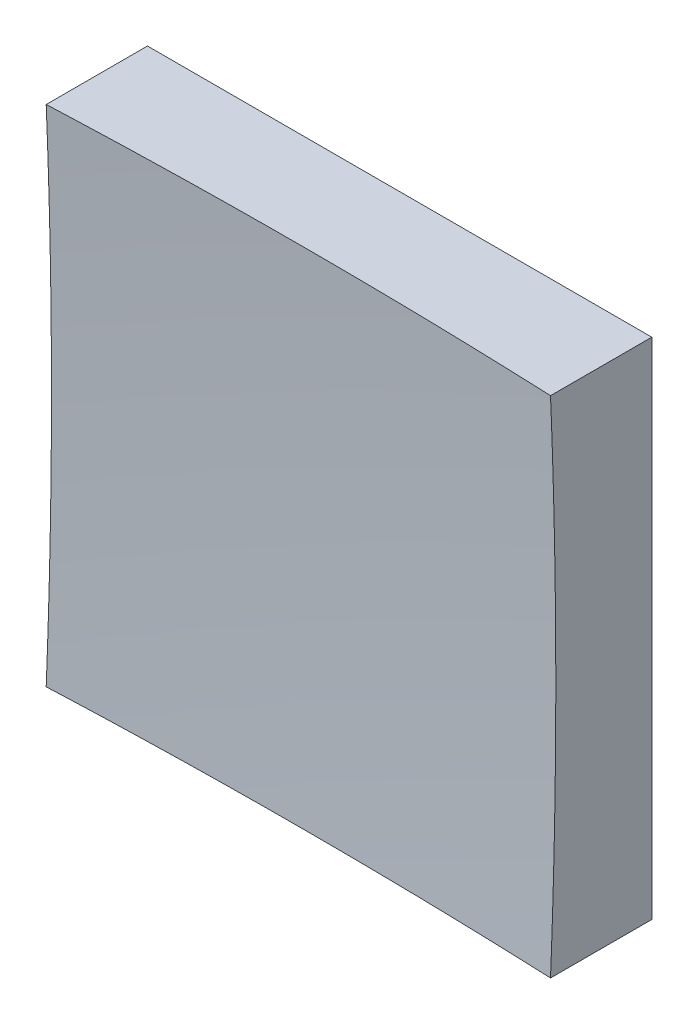
ISO-10303-21;
HEADER;
FILE_DESCRIPTION(('STEP AP214'),'2;1');
FILE_NAME('part.step','',(''),(''),'','','');
FILE_SCHEMA(('AUTOMOTIVE_DESIGN { 1 0 10303 214 1 1 1 1 }'));
ENDSEC;
DATA;
#1=APPLICATION_CONTEXT('core data for automotive mechanical design processes');
#2=APPLICATION_PROTOCOL_DEFINITION('international standard','automotive_design',2000,#1);
#3=PRODUCT_CONTEXT('',#1,'mechanical');
#4=PRODUCT('Part','Part','',(#3));
#5=PRODUCT_RELATED_PRODUCT_CATEGORY('part','',(#4));
#6=PRODUCT_DEFINITION_FORMATION('','',#4);
#7=PRODUCT_DEFINITION_CONTEXT('part definition',#1,'design');
#8=PRODUCT_DEFINITION('design','',#6,#7);
#9=PRODUCT_DEFINITION_SHAPE('','',#8);
#10=(LENGTH_UNIT() NAMED_UNIT(*) SI_UNIT(.MILLI.,.METRE.));
#11=(NAMED_UNIT(*) PLANE_ANGLE_UNIT() SI_UNIT($,.RADIAN.));
#12=(NAMED_UNIT(*) SI_UNIT($,.STERADIAN.) SOLID_ANGLE_UNIT());
#13=UNCERTAINTY_MEASURE_WITH_UNIT(LENGTH_MEASURE(1.E-05),#10,'distance_accuracy_value','');
#14=(GEOMETRIC_REPRESENTATION_CONTEXT(3) GLOBAL_UNCERTAINTY_ASSIGNED_CONTEXT((#13)) GLOBAL_UNIT_ASSIGNED_CONTEXT((#10,
#11,#12)) REPRESENTATION_CONTEXT('',''));
#15=CARTESIAN_POINT('',(0.,0.,0.));
#16=DIRECTION('',(0.,0.,1.));
#17=DIRECTION('',(1.,0.,0.));
#18=AXIS2_PLACEMENT_3D('',#15,#16,#17);
#19=CARTESIAN_POINT('',(-25.,25.,50.));
#20=DIRECTION('',(0.,1.,0.));
#21=DIRECTION('',(0.,0.,1.));
#22=AXIS2_PLACEMENT_3D('',#19,#20,#21);
#23=PLANE('',#22);
#24=CARTESIAN_POINT('',(0.,25.,609.));
#25=DIRECTION('',(0.,1.,0.));
#26=DIRECTION('',(0.,0.,1.));
#27=AXIS2_PLACEMENT_3D('',#24,#25,#26);
#28=CIRCLE('',#27,599.47894041409);
#29=CARTESIAN_POINT('',(25.,25.,10.0425724644531));
#30=VERTEX_POINT('',#29);
#31=CARTESIAN_POINT('',(-25.,25.,10.0425724644531));
#32=VERTEX_POINT('',#31);
#33=EDGE_CURVE('E79',#30,#32,#28,.T.);
#34=ORIENTED_EDGE('',*,*,#33,.F.);
#35=DIRECTION('',(0.,0.,-1.));
#36=VECTOR('',#35,1.);
#37=CARTESIAN_POINT('',(25.,25.,50.));
#38=LINE('',#37,#36);
#39=CARTESIAN_POINT('',(25.,25.,0.));
#40=VERTEX_POINT('',#39);
#41=EDGE_CURVE('E85',#30,#40,#38,.T.);
#42=ORIENTED_EDGE('',*,*,#41,.T.);
#43=DIRECTION('',(1.,0.,0.));
#44=VECTOR('',#43,1.);
#45=CARTESIAN_POINT('',(-25.,25.,0.));
#46=LINE('',#45,#44);
#47=CARTESIAN_POINT('',(-25.,25.,0.));
#48=VERTEX_POINT('',#47);
#49=EDGE_CURVE('E88',#48,#40,#46,.T.);
#50=ORIENTED_EDGE('',*,*,#49,.F.);
#51=DIRECTION('',(0.,0.,-1.));
#52=VECTOR('',#51,1.);
#53=CARTESIAN_POINT('',(-25.,25.,50.));
#54=LINE('',#53,#52);
#55=EDGE_CURVE('E47',#32,#48,#54,.T.);
#56=ORIENTED_EDGE('',*,*,#55,.F.);
#57=EDGE_LOOP('',(#34,#42,#50,#56));
#58=FACE_BOUND('',#57,.T.);
#59=ADVANCED_FACE('F39',(#58),#23,.T.);
#60=CARTESIAN_POINT('',(-25.,25.,50.));
#61=DIRECTION('',(1.,0.,0.));
#62=DIRECTION('',(0.,1.,0.));
#63=AXIS2_PLACEMENT_3D('',#60,#61,#62);
#64=PLANE('',#63);
#65=DIRECTION('',(0.,0.,-1.));
#66=VECTOR('',#65,1.);
#67=CARTESIAN_POINT('',(-25.,-25.,50.));
#68=LINE('',#67,#66);
#69=CARTESIAN_POINT('',(-25.,-25.,10.0425724644531));
#70=VERTEX_POINT('',#69);
#71=CARTESIAN_POINT('',(-25.,-25.,0.));
#72=VERTEX_POINT('',#71);
#73=EDGE_CURVE('E100',#70,#72,#68,.T.);
#74=ORIENTED_EDGE('',*,*,#73,.F.);
#75=CARTESIAN_POINT('',(-25.,0.,609.));
#76=DIRECTION('',(1.,0.,0.));
#77=DIRECTION('',(0.,1.,0.));
#78=AXIS2_PLACEMENT_3D('',#75,#76,#77);
#79=CIRCLE('',#78,599.47894041409);
#80=EDGE_CURVE('E89',#70,#32,#79,.T.);
#81=ORIENTED_EDGE('',*,*,#80,.T.);
#82=ORIENTED_EDGE('',*,*,#55,.T.);
#83=DIRECTION('',(0.,-1.,0.));
#84=VECTOR('',#83,1.);
#85=CARTESIAN_POINT('',(-25.,25.,0.));
#86=LINE('',#85,#84);
#87=EDGE_CURVE('E97',#48,#72,#86,.T.);
#88=ORIENTED_EDGE('',*,*,#87,.T.);
#89=EDGE_LOOP('',(#74,#81,#82,#88));
#90=FACE_BOUND('',#89,.T.);
#91=ADVANCED_FACE('F122',(#90),#64,.F.);
#92=CARTESIAN_POINT('',(-25.,-25.,50.));
#93=DIRECTION('',(0.,1.,0.));
#94=DIRECTION('',(0.,0.,1.));
#95=AXIS2_PLACEMENT_3D('',#92,#93,#94);
#96=PLANE('',#95);
#97=DIRECTION('',(0.,0.,-1.));
#98=VECTOR('',#97,1.);
#99=CARTESIAN_POINT('',(25.,-25.,50.));
#100=LINE('',#99,#98);
#101=CARTESIAN_POINT('',(25.,-25.,10.0425724644531));
#102=VERTEX_POINT('',#101);
#103=CARTESIAN_POINT('',(25.,-25.,0.));
#104=VERTEX_POINT('',#103);
#105=EDGE_CURVE('E96',#102,#104,#100,.T.);
#106=ORIENTED_EDGE('',*,*,#105,.F.);
#107=CARTESIAN_POINT('',(0.,-25.,609.));
#108=DIRECTION('',(0.,1.,0.));
#109=DIRECTION('',(0.,0.,1.));
#110=AXIS2_PLACEMENT_3D('',#107,#108,#109);
#111=CIRCLE('',#110,599.47894041409);
#112=EDGE_CURVE('E53',#102,#70,#111,.T.);
#113=ORIENTED_EDGE('',*,*,#112,.T.);
#114=ORIENTED_EDGE('',*,*,#73,.T.);
#115=DIRECTION('',(1.,0.,0.));
#116=VECTOR('',#115,1.);
#117=CARTESIAN_POINT('',(-25.,-25.,0.));
#118=LINE('',#117,#116);
#119=EDGE_CURVE('E102',#72,#104,#118,.T.);
#120=ORIENTED_EDGE('',*,*,#119,.T.);
#121=EDGE_LOOP('',(#106,#113,#114,#120));
#122=FACE_BOUND('',#121,.T.);
#123=ADVANCED_FACE('F121',(#122),#96,.F.);
#124=CARTESIAN_POINT('',(25.,25.,50.));
#125=DIRECTION('',(1.,0.,0.));
#126=DIRECTION('',(0.,1.,0.));
#127=AXIS2_PLACEMENT_3D('',#124,#125,#126);
#128=PLANE('',#127);
#129=CARTESIAN_POINT('',(25.,0.,609.));
#130=DIRECTION('',(1.,0.,0.));
#131=DIRECTION('',(0.,1.,0.));
#132=AXIS2_PLACEMENT_3D('',#129,#130,#131);
#133=CIRCLE('',#132,599.47894041409);
#134=EDGE_CURVE('E11',#102,#30,#133,.T.);
#135=ORIENTED_EDGE('',*,*,#134,.F.);
#136=ORIENTED_EDGE('',*,*,#105,.T.);
#137=DIRECTION('',(0.,-1.,0.));
#138=VECTOR('',#137,1.);
#139=CARTESIAN_POINT('',(25.,25.,0.));
#140=LINE('',#139,#138);
#141=EDGE_CURVE('E93',#40,#104,#140,.T.);
#142=ORIENTED_EDGE('',*,*,#141,.F.);
#143=ORIENTED_EDGE('',*,*,#41,.F.);
#144=EDGE_LOOP('',(#135,#136,#142,#143));
#145=FACE_BOUND('',#144,.T.);
#146=ADVANCED_FACE('F91',(#145),#128,.T.);
#147=CARTESIAN_POINT('',(0.,0.,0.));
#148=DIRECTION('',(0.,0.,-1.));
#149=DIRECTION('',(-1.,0.,0.));
#150=AXIS2_PLACEMENT_3D('',#147,#148,#149);
#151=PLANE('',#150);
#152=ORIENTED_EDGE('',*,*,#49,.T.);
#153=ORIENTED_EDGE('',*,*,#141,.T.);
#154=ORIENTED_EDGE('',*,*,#119,.F.);
#155=ORIENTED_EDGE('',*,*,#87,.F.);
#156=EDGE_LOOP('',(#152,#153,#154,#155));
#157=FACE_BOUND('',#156,.T.);
#158=ADVANCED_FACE('F125',(#157),#151,.T.);
#159=CARTESIAN_POINT('',(0.,0.,609.));
#160=DIRECTION('',(0.,0.,1.));
#161=DIRECTION('',(1.,0.,0.));
#162=AXIS2_PLACEMENT_3D('',#159,#160,#161);
#163=SPHERICAL_SURFACE('',#162,600.);
#164=ORIENTED_EDGE('',*,*,#33,.T.);
#165=ORIENTED_EDGE('',*,*,#80,.F.);
#166=ORIENTED_EDGE('',*,*,#112,.F.);
#167=ORIENTED_EDGE('',*,*,#134,.T.);
#168=EDGE_LOOP('',(#164,#165,#166,#167));
#169=FACE_BOUND('',#168,.T.);
#170=ADVANCED_FACE('F78',(#169),#163,.F.);
#171=CLOSED_SHELL('',(#59,#91,#123,#146,#158,#170));
#172=MANIFOLD_SOLID_BREP('B2',#171);
#173=ADVANCED_BREP_SHAPE_REPRESENTATION('',(#18,#172),#14);
#174=SHAPE_DEFINITION_REPRESENTATION(#9,#173);
ENDSEC;
END-ISO-10303-21;
